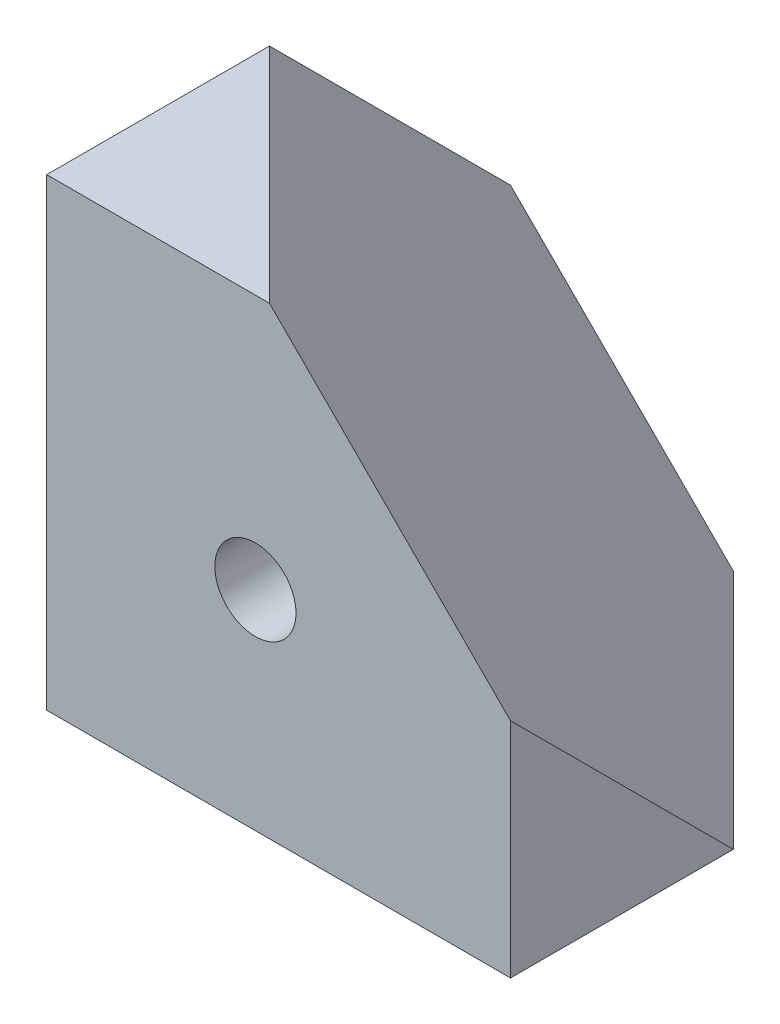
ISO-10303-21;
HEADER;
FILE_DESCRIPTION(('STEP AP214'),'2;1');
FILE_NAME('part.step','',(''),(''),'','','');
FILE_SCHEMA(('AUTOMOTIVE_DESIGN { 1 0 10303 214 1 1 1 1 }'));
ENDSEC;
DATA;
#1=APPLICATION_CONTEXT('core data for automotive mechanical design processes');
#2=APPLICATION_PROTOCOL_DEFINITION('international standard','automotive_design',2000,#1);
#3=PRODUCT_CONTEXT('',#1,'mechanical');
#4=PRODUCT('Part','Part','',(#3));
#5=PRODUCT_RELATED_PRODUCT_CATEGORY('part','',(#4));
#6=PRODUCT_DEFINITION_FORMATION('','',#4);
#7=PRODUCT_DEFINITION_CONTEXT('part definition',#1,'design');
#8=PRODUCT_DEFINITION('design','',#6,#7);
#9=PRODUCT_DEFINITION_SHAPE('','',#8);
#10=(LENGTH_UNIT() NAMED_UNIT(*) SI_UNIT(.MILLI.,.METRE.));
#11=(NAMED_UNIT(*) PLANE_ANGLE_UNIT() SI_UNIT($,.RADIAN.));
#12=(NAMED_UNIT(*) SI_UNIT($,.STERADIAN.) SOLID_ANGLE_UNIT());
#13=UNCERTAINTY_MEASURE_WITH_UNIT(LENGTH_MEASURE(1.E-05),#10,'distance_accuracy_value','');
#14=(GEOMETRIC_REPRESENTATION_CONTEXT(3) GLOBAL_UNCERTAINTY_ASSIGNED_CONTEXT((#13)) GLOBAL_UNIT_ASSIGNED_CONTEXT((#10,
#11,#12)) REPRESENTATION_CONTEXT('',''));
#15=CARTESIAN_POINT('',(0.,0.,0.));
#16=DIRECTION('',(0.,0.,1.));
#17=DIRECTION('',(1.,0.,0.));
#18=AXIS2_PLACEMENT_3D('',#15,#16,#17);
#19=CARTESIAN_POINT('',(9.,-1.2E-05,11.));
#20=DIRECTION('',(0.,1.,0.));
#21=DIRECTION('',(0.,0.,1.));
#22=AXIS2_PLACEMENT_3D('',#19,#20,#21);
#23=CYLINDRICAL_SURFACE('',#22,1.75);
#24=CARTESIAN_POINT('',(9.,0.,11.));
#25=DIRECTION('',(0.,1.,0.));
#26=DIRECTION('',(0.,0.,1.));
#27=AXIS2_PLACEMENT_3D('',#24,#25,#26);
#28=CIRCLE('',#27,1.75);
#29=CARTESIAN_POINT('',(9.,0.,12.75));
#30=VERTEX_POINT('',#29);
#31=EDGE_CURVE('E128',#30,#30,#28,.F.);
#32=ORIENTED_EDGE('',*,*,#31,.T.);
#33=EDGE_LOOP('',(#32));
#34=FACE_BOUND('',#33,.T.);
#35=CARTESIAN_POINT('',(9.,8.,11.));
#36=DIRECTION('',(0.,-1.,0.));
#37=DIRECTION('',(0.,0.,-1.));
#38=AXIS2_PLACEMENT_3D('',#35,#36,#37);
#39=CIRCLE('',#38,1.75);
#40=CARTESIAN_POINT('',(8.,8.,9.56385933836549));
#41=VERTEX_POINT('',#40);
#42=CARTESIAN_POINT('',(10.4361406616345,8.,12.));
#43=VERTEX_POINT('',#42);
#44=EDGE_CURVE('E126',#41,#43,#39,.T.);
#45=ORIENTED_EDGE('',*,*,#44,.F.);
#46=CARTESIAN_POINT('',(9.,9.,11.));
#47=DIRECTION('',(-0.707106781186547,0.707106781186547,0.));
#48=DIRECTION('',(0.707106781186547,0.707106781186547,0.));
#49=AXIS2_PLACEMENT_3D('',#46,#47,#48);
#50=ELLIPSE('',#49,2.47487373415292,1.75);
#51=CARTESIAN_POINT('',(7.76256313292354,7.76256313292354,12.2374368670765));
#52=VERTEX_POINT('',#51);
#53=EDGE_CURVE('E105',#41,#52,#50,.T.);
#54=ORIENTED_EDGE('',*,*,#53,.T.);
#55=CARTESIAN_POINT('',(9.,9.,11.));
#56=DIRECTION('',(0.,0.707106781186547,0.707106781186547));
#57=DIRECTION('',(0.,0.707106781186547,-0.707106781186547));
#58=AXIS2_PLACEMENT_3D('',#55,#56,#57);
#59=ELLIPSE('',#58,2.47487373415292,1.75);
#60=EDGE_CURVE('E113',#52,#43,#59,.T.);
#61=ORIENTED_EDGE('',*,*,#60,.T.);
#62=EDGE_LOOP('',(#45,#54,#61));
#63=FACE_BOUND('',#62,.T.);
#64=ADVANCED_FACE('F33',(#34,#63),#23,.F.);
#65=CARTESIAN_POINT('',(9.,8.,11.));
#66=DIRECTION('',(0.,-1.,0.));
#67=DIRECTION('',(0.,0.,-1.));
#68=AXIS2_PLACEMENT_3D('',#65,#66,#67);
#69=PLANE('',#68);
#70=DIRECTION('',(-1.,0.,0.));
#71=VECTOR('',#70,1.);
#72=CARTESIAN_POINT('',(9.,8.,12.));
#73=LINE('',#72,#71);
#74=CARTESIAN_POINT('',(8.,8.,12.));
#75=VERTEX_POINT('',#74);
#76=EDGE_CURVE('E41',#43,#75,#73,.T.);
#77=ORIENTED_EDGE('',*,*,#76,.T.);
#78=DIRECTION('',(0.,0.,-1.));
#79=VECTOR('',#78,1.);
#80=CARTESIAN_POINT('',(8.,8.,11.));
#81=LINE('',#80,#79);
#82=EDGE_CURVE('E48',#75,#41,#81,.T.);
#83=ORIENTED_EDGE('',*,*,#82,.T.);
#84=ORIENTED_EDGE('',*,*,#44,.T.);
#85=EDGE_LOOP('',(#77,#83,#84));
#86=FACE_BOUND('',#85,.T.);
#87=ADVANCED_FACE('F170',(#86),#69,.T.);
#88=CARTESIAN_POINT('',(9.,9.,20.000012));
#89=DIRECTION('',(0.,0.,-1.));
#90=DIRECTION('',(-1.,0.,0.));
#91=AXIS2_PLACEMENT_3D('',#88,#89,#90);
#92=CYLINDRICAL_SURFACE('',#91,1.75);
#93=CARTESIAN_POINT('',(9.,9.,20.));
#94=DIRECTION('',(0.,0.,-1.));
#95=DIRECTION('',(-1.,0.,0.));
#96=AXIS2_PLACEMENT_3D('',#93,#94,#95);
#97=CIRCLE('',#96,1.75);
#98=CARTESIAN_POINT('',(7.25,9.,20.));
#99=VERTEX_POINT('',#98);
#100=EDGE_CURVE('E118',#99,#99,#97,.F.);
#101=ORIENTED_EDGE('',*,*,#100,.T.);
#102=EDGE_LOOP('',(#101));
#103=FACE_BOUND('',#102,.T.);
#104=ORIENTED_EDGE('',*,*,#60,.F.);
#105=CARTESIAN_POINT('',(9.,9.,11.));
#106=DIRECTION('',(-0.707106781186547,0.,-0.707106781186547));
#107=DIRECTION('',(0.707106781186547,0.,-0.707106781186547));
#108=AXIS2_PLACEMENT_3D('',#105,#106,#107);
#109=ELLIPSE('',#108,2.47487373415292,1.75);
#110=CARTESIAN_POINT('',(8.,10.4361406616345,12.));
#111=VERTEX_POINT('',#110);
#112=EDGE_CURVE('E103',#52,#111,#109,.T.);
#113=ORIENTED_EDGE('',*,*,#112,.T.);
#114=CARTESIAN_POINT('',(9.,9.,12.));
#115=DIRECTION('',(0.,0.,1.));
#116=DIRECTION('',(1.,0.,0.));
#117=AXIS2_PLACEMENT_3D('',#114,#115,#116);
#118=CIRCLE('',#117,1.75);
#119=EDGE_CURVE('E111',#43,#111,#118,.T.);
#120=ORIENTED_EDGE('',*,*,#119,.F.);
#121=EDGE_LOOP('',(#104,#113,#120));
#122=FACE_BOUND('',#121,.T.);
#123=ADVANCED_FACE('F110',(#103,#122),#92,.F.);
#124=CARTESIAN_POINT('',(9.,9.,12.));
#125=DIRECTION('',(0.,0.,1.));
#126=DIRECTION('',(1.,0.,0.));
#127=AXIS2_PLACEMENT_3D('',#124,#125,#126);
#128=PLANE('',#127);
#129=ORIENTED_EDGE('',*,*,#119,.T.);
#130=DIRECTION('',(0.,-1.,0.));
#131=VECTOR('',#130,1.);
#132=CARTESIAN_POINT('',(8.,9.,12.));
#133=LINE('',#132,#131);
#134=EDGE_CURVE('E11',#111,#75,#133,.T.);
#135=ORIENTED_EDGE('',*,*,#134,.T.);
#136=ORIENTED_EDGE('',*,*,#76,.F.);
#137=EDGE_LOOP('',(#129,#135,#136));
#138=FACE_BOUND('',#137,.T.);
#139=ADVANCED_FACE('F115',(#138),#128,.T.);
#140=CARTESIAN_POINT('',(0.,0.,20.));
#141=DIRECTION('',(1.,0.,0.));
#142=DIRECTION('',(0.,0.,-1.));
#143=AXIS2_PLACEMENT_3D('',#140,#141,#142);
#144=PLANE('',#143);
#145=CARTESIAN_POINT('',(0.,9.,11.));
#146=DIRECTION('',(1.,0.,0.));
#147=DIRECTION('',(0.,0.,-1.));
#148=AXIS2_PLACEMENT_3D('',#145,#146,#147);
#149=CIRCLE('',#148,1.75);
#150=CARTESIAN_POINT('',(0.,9.,9.25));
#151=VERTEX_POINT('',#150);
#152=EDGE_CURVE('E116',#151,#151,#149,.F.);
#153=ORIENTED_EDGE('',*,*,#152,.F.);
#154=EDGE_LOOP('',(#153));
#155=FACE_BOUND('',#154,.T.);
#156=DIRECTION('',(0.,0.,-1.));
#157=VECTOR('',#156,1.);
#158=CARTESIAN_POINT('',(0.,20.,20.));
#159=LINE('',#158,#157);
#160=CARTESIAN_POINT('',(0.,20.,20.));
#161=VERTEX_POINT('',#160);
#162=CARTESIAN_POINT('',(0.,20.,10.3923048454133));
#163=VERTEX_POINT('',#162);
#164=EDGE_CURVE('E154',#161,#163,#159,.T.);
#165=ORIENTED_EDGE('',*,*,#164,.T.);
#166=DIRECTION('',(0.,-0.707106781186547,-0.707106781186547));
#167=VECTOR('',#166,1.);
#168=CARTESIAN_POINT('',(0.,14.8038475772934,5.19615242270663));
#169=LINE('',#168,#167);
#170=CARTESIAN_POINT('',(0.,9.60769515458673,0.));
#171=VERTEX_POINT('',#170);
#172=EDGE_CURVE('E130',#163,#171,#169,.T.);
#173=ORIENTED_EDGE('',*,*,#172,.T.);
#174=DIRECTION('',(0.,-1.,0.));
#175=VECTOR('',#174,1.);
#176=CARTESIAN_POINT('',(0.,0.,0.));
#177=LINE('',#176,#175);
#178=CARTESIAN_POINT('',(0.,0.,0.));
#179=VERTEX_POINT('',#178);
#180=EDGE_CURVE('E142',#171,#179,#177,.T.);
#181=ORIENTED_EDGE('',*,*,#180,.T.);
#182=DIRECTION('',(0.,0.,-1.));
#183=VECTOR('',#182,1.);
#184=CARTESIAN_POINT('',(0.,0.,20.));
#185=LINE('',#184,#183);
#186=CARTESIAN_POINT('',(0.,0.,20.));
#187=VERTEX_POINT('',#186);
#188=EDGE_CURVE('E163',#187,#179,#185,.T.);
#189=ORIENTED_EDGE('',*,*,#188,.F.);
#190=DIRECTION('',(0.,-1.,0.));
#191=VECTOR('',#190,1.);
#192=CARTESIAN_POINT('',(0.,0.,20.));
#193=LINE('',#192,#191);
#194=EDGE_CURVE('E143',#161,#187,#193,.T.);
#195=ORIENTED_EDGE('',*,*,#194,.F.);
#196=EDGE_LOOP('',(#165,#173,#181,#189,#195));
#197=FACE_BOUND('',#196,.T.);
#198=ADVANCED_FACE('F35',(#155,#197),#144,.F.);
#199=CARTESIAN_POINT('',(0.,0.,20.));
#200=DIRECTION('',(0.,1.,0.));
#201=DIRECTION('',(0.,0.,1.));
#202=AXIS2_PLACEMENT_3D('',#199,#200,#201);
#203=PLANE('',#202);
#204=ORIENTED_EDGE('',*,*,#31,.F.);
#205=EDGE_LOOP('',(#204));
#206=FACE_BOUND('',#205,.T.);
#207=DIRECTION('',(1.,0.,0.));
#208=VECTOR('',#207,1.);
#209=CARTESIAN_POINT('',(0.,0.,0.));
#210=LINE('',#209,#208);
#211=CARTESIAN_POINT('',(9.60769515458674,0.,0.));
#212=VERTEX_POINT('',#211);
#213=EDGE_CURVE('E147',#179,#212,#210,.T.);
#214=ORIENTED_EDGE('',*,*,#213,.T.);
#215=DIRECTION('',(0.707106781186547,0.,0.707106781186547));
#216=VECTOR('',#215,1.);
#217=CARTESIAN_POINT('',(14.8038475772934,0.,5.19615242270663));
#218=LINE('',#217,#216);
#219=CARTESIAN_POINT('',(20.,0.,10.3923048454133));
#220=VERTEX_POINT('',#219);
#221=EDGE_CURVE('E55',#212,#220,#218,.T.);
#222=ORIENTED_EDGE('',*,*,#221,.T.);
#223=DIRECTION('',(0.,0.,-1.));
#224=VECTOR('',#223,1.);
#225=CARTESIAN_POINT('',(20.,0.,20.));
#226=LINE('',#225,#224);
#227=CARTESIAN_POINT('',(20.,0.,20.));
#228=VERTEX_POINT('',#227);
#229=EDGE_CURVE('E160',#228,#220,#226,.T.);
#230=ORIENTED_EDGE('',*,*,#229,.F.);
#231=DIRECTION('',(1.,0.,0.));
#232=VECTOR('',#231,1.);
#233=CARTESIAN_POINT('',(0.,0.,20.));
#234=LINE('',#233,#232);
#235=EDGE_CURVE('E146',#187,#228,#234,.T.);
#236=ORIENTED_EDGE('',*,*,#235,.F.);
#237=ORIENTED_EDGE('',*,*,#188,.T.);
#238=EDGE_LOOP('',(#214,#222,#230,#236,#237));
#239=FACE_BOUND('',#238,.T.);
#240=ADVANCED_FACE('F200',(#206,#239),#203,.F.);
#241=CARTESIAN_POINT('',(20.,0.,20.));
#242=DIRECTION('',(-1.,0.,0.));
#243=DIRECTION('',(0.,0.,1.));
#244=AXIS2_PLACEMENT_3D('',#241,#242,#243);
#245=PLANE('',#244);
#246=ORIENTED_EDGE('',*,*,#229,.T.);
#247=DIRECTION('',(0.,0.707106781186547,0.707106781186547));
#248=VECTOR('',#247,1.);
#249=CARTESIAN_POINT('',(20.,4.80384757729337,15.1961524227066));
#250=LINE('',#249,#248);
#251=CARTESIAN_POINT('',(20.,9.60769515458673,20.));
#252=VERTEX_POINT('',#251);
#253=EDGE_CURVE('E136',#220,#252,#250,.T.);
#254=ORIENTED_EDGE('',*,*,#253,.T.);
#255=DIRECTION('',(0.,1.,0.));
#256=VECTOR('',#255,1.);
#257=CARTESIAN_POINT('',(20.,0.,20.));
#258=LINE('',#257,#256);
#259=EDGE_CURVE('E149',#228,#252,#258,.T.);
#260=ORIENTED_EDGE('',*,*,#259,.F.);
#261=EDGE_LOOP('',(#246,#254,#260));
#262=FACE_BOUND('',#261,.T.);
#263=ADVANCED_FACE('F197',(#262),#245,.F.);
#264=CARTESIAN_POINT('',(0.,20.,20.));
#265=DIRECTION('',(0.,-1.,0.));
#266=DIRECTION('',(0.,0.,-1.));
#267=AXIS2_PLACEMENT_3D('',#264,#265,#266);
#268=PLANE('',#267);
#269=DIRECTION('',(-1.,0.,0.));
#270=VECTOR('',#269,1.);
#271=CARTESIAN_POINT('',(0.,20.,20.));
#272=LINE('',#271,#270);
#273=CARTESIAN_POINT('',(9.60769515458673,20.,20.));
#274=VERTEX_POINT('',#273);
#275=EDGE_CURVE('E152',#274,#161,#272,.T.);
#276=ORIENTED_EDGE('',*,*,#275,.F.);
#277=DIRECTION('',(-0.707106781186547,0.,-0.707106781186547));
#278=VECTOR('',#277,1.);
#279=CARTESIAN_POINT('',(4.80384757729337,20.,15.1961524227066));
#280=LINE('',#279,#278);
#281=EDGE_CURVE('E133',#274,#163,#280,.T.);
#282=ORIENTED_EDGE('',*,*,#281,.T.);
#283=ORIENTED_EDGE('',*,*,#164,.F.);
#284=EDGE_LOOP('',(#276,#282,#283));
#285=FACE_BOUND('',#284,.T.);
#286=ADVANCED_FACE('F190',(#285),#268,.F.);
#287=CARTESIAN_POINT('',(0.,0.,20.));
#288=DIRECTION('',(0.,0.,-1.));
#289=DIRECTION('',(-1.,0.,0.));
#290=AXIS2_PLACEMENT_3D('',#287,#288,#289);
#291=PLANE('',#290);
#292=ORIENTED_EDGE('',*,*,#100,.F.);
#293=EDGE_LOOP('',(#292));
#294=FACE_BOUND('',#293,.T.);
#295=ORIENTED_EDGE('',*,*,#259,.T.);
#296=DIRECTION('',(-0.707106781186547,0.707106781186547,0.));
#297=VECTOR('',#296,1.);
#298=CARTESIAN_POINT('',(14.8038475772934,14.8038475772934,20.));
#299=LINE('',#298,#297);
#300=EDGE_CURVE('E139',#252,#274,#299,.T.);
#301=ORIENTED_EDGE('',*,*,#300,.T.);
#302=ORIENTED_EDGE('',*,*,#275,.T.);
#303=ORIENTED_EDGE('',*,*,#194,.T.);
#304=ORIENTED_EDGE('',*,*,#235,.T.);
#305=EDGE_LOOP('',(#295,#301,#302,#303,#304));
#306=FACE_BOUND('',#305,.T.);
#307=ADVANCED_FACE('F187',(#294,#306),#291,.F.);
#308=CARTESIAN_POINT('',(0.,0.,0.));
#309=DIRECTION('',(0.,0.,-1.));
#310=DIRECTION('',(-1.,0.,0.));
#311=AXIS2_PLACEMENT_3D('',#308,#309,#310);
#312=PLANE('',#311);
#313=DIRECTION('',(-0.707106781186547,0.707106781186547,0.));
#314=VECTOR('',#313,1.);
#315=CARTESIAN_POINT('',(4.80384757729337,4.80384757729337,0.));
#316=LINE('',#315,#314);
#317=EDGE_CURVE('E166',#212,#171,#316,.T.);
#318=ORIENTED_EDGE('',*,*,#317,.F.);
#319=ORIENTED_EDGE('',*,*,#213,.F.);
#320=ORIENTED_EDGE('',*,*,#180,.F.);
#321=EDGE_LOOP('',(#318,#319,#320));
#322=FACE_BOUND('',#321,.T.);
#323=ADVANCED_FACE('F186',(#322),#312,.T.);
#324=CARTESIAN_POINT('',(3.20256505152891,3.20256505152891,-3.20256505152891));
#325=DIRECTION('',(-0.577350269189626,-0.577350269189626,0.577350269189626));
#326=DIRECTION('',(0.707106781186547,0.,0.707106781186547));
#327=AXIS2_PLACEMENT_3D('',#324,#325,#326);
#328=PLANE('',#327);
#329=ORIENTED_EDGE('',*,*,#253,.F.);
#330=ORIENTED_EDGE('',*,*,#221,.F.);
#331=ORIENTED_EDGE('',*,*,#317,.T.);
#332=ORIENTED_EDGE('',*,*,#172,.F.);
#333=ORIENTED_EDGE('',*,*,#281,.F.);
#334=ORIENTED_EDGE('',*,*,#300,.F.);
#335=EDGE_LOOP('',(#329,#330,#331,#332,#333,#334));
#336=FACE_BOUND('',#335,.T.);
#337=ADVANCED_FACE('F183',(#336),#328,.F.);
#338=CARTESIAN_POINT('',(-1.2E-05,9.,11.));
#339=DIRECTION('',(1.,0.,0.));
#340=DIRECTION('',(0.,0.,-1.));
#341=AXIS2_PLACEMENT_3D('',#338,#339,#340);
#342=CYLINDRICAL_SURFACE('',#341,1.75);
#343=CARTESIAN_POINT('',(8.,9.,11.));
#344=DIRECTION('',(-1.,0.,0.));
#345=DIRECTION('',(0.,0.,1.));
#346=AXIS2_PLACEMENT_3D('',#343,#344,#345);
#347=CIRCLE('',#346,1.75);
#348=EDGE_CURVE('E94',#111,#41,#347,.T.);
#349=ORIENTED_EDGE('',*,*,#348,.F.);
#350=ORIENTED_EDGE('',*,*,#112,.F.);
#351=ORIENTED_EDGE('',*,*,#53,.F.);
#352=EDGE_LOOP('',(#349,#350,#351));
#353=FACE_BOUND('',#352,.T.);
#354=ORIENTED_EDGE('',*,*,#152,.T.);
#355=EDGE_LOOP('',(#354));
#356=FACE_BOUND('',#355,.T.);
#357=ADVANCED_FACE('F101',(#353,#356),#342,.F.);
#358=CARTESIAN_POINT('',(8.,9.,11.));
#359=DIRECTION('',(-1.,0.,0.));
#360=DIRECTION('',(0.,0.,1.));
#361=AXIS2_PLACEMENT_3D('',#358,#359,#360);
#362=PLANE('',#361);
#363=ORIENTED_EDGE('',*,*,#134,.F.);
#364=ORIENTED_EDGE('',*,*,#348,.T.);
#365=ORIENTED_EDGE('',*,*,#82,.F.);
#366=EDGE_LOOP('',(#363,#364,#365));
#367=FACE_BOUND('',#366,.T.);
#368=ADVANCED_FACE('F93',(#367),#362,.T.);
#369=CLOSED_SHELL('',(#64,#87,#123,#139,#198,#240,#263,#286,#307,#323,#337,#357,#368));
#370=MANIFOLD_SOLID_BREP('B2',#369);
#371=ADVANCED_BREP_SHAPE_REPRESENTATION('',(#18,#370),#14);
#372=SHAPE_DEFINITION_REPRESENTATION(#9,#371);
ENDSEC;
END-ISO-10303-21;
